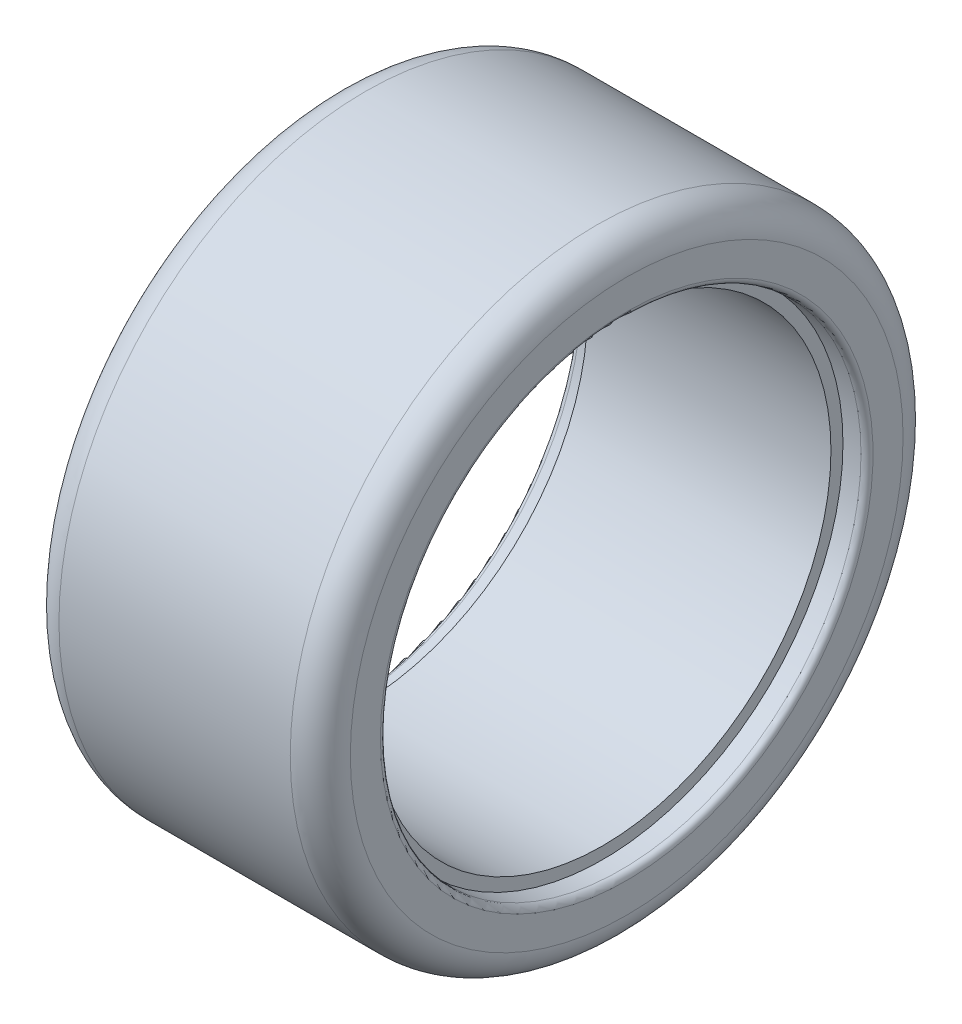
ISO-10303-21;
HEADER;
FILE_DESCRIPTION(('STEP AP214'),'2;1');
FILE_NAME('part.step','',(''),(''),'','','');
FILE_SCHEMA(('AUTOMOTIVE_DESIGN { 1 0 10303 214 1 1 1 1 }'));
ENDSEC;
DATA;
#1=APPLICATION_CONTEXT('core data for automotive mechanical design processes');
#2=APPLICATION_PROTOCOL_DEFINITION('international standard','automotive_design',2000,#1);
#3=PRODUCT_CONTEXT('',#1,'mechanical');
#4=PRODUCT('Part','Part','',(#3));
#5=PRODUCT_RELATED_PRODUCT_CATEGORY('part','',(#4));
#6=PRODUCT_DEFINITION_FORMATION('','',#4);
#7=PRODUCT_DEFINITION_CONTEXT('part definition',#1,'design');
#8=PRODUCT_DEFINITION('design','',#6,#7);
#9=PRODUCT_DEFINITION_SHAPE('','',#8);
#10=(LENGTH_UNIT() NAMED_UNIT(*) SI_UNIT(.MILLI.,.METRE.));
#11=(NAMED_UNIT(*) PLANE_ANGLE_UNIT() SI_UNIT($,.RADIAN.));
#12=(NAMED_UNIT(*) SI_UNIT($,.STERADIAN.) SOLID_ANGLE_UNIT());
#13=UNCERTAINTY_MEASURE_WITH_UNIT(LENGTH_MEASURE(1.E-05),#10,'distance_accuracy_value','');
#14=(GEOMETRIC_REPRESENTATION_CONTEXT(3) GLOBAL_UNCERTAINTY_ASSIGNED_CONTEXT((#13)) GLOBAL_UNIT_ASSIGNED_CONTEXT((#10,
#11,#12)) REPRESENTATION_CONTEXT('',''));
#15=CARTESIAN_POINT('',(0.,0.,0.));
#16=DIRECTION('',(0.,0.,1.));
#17=DIRECTION('',(1.,0.,0.));
#18=AXIS2_PLACEMENT_3D('',#15,#16,#17);
#19=CARTESIAN_POINT('',(0.,0.,0.));
#20=DIRECTION('',(-1.,0.,0.));
#21=DIRECTION('',(0.,0.,1.));
#22=AXIS2_PLACEMENT_3D('',#19,#20,#21);
#23=CYLINDRICAL_SURFACE('',#22,19.);
#24=CARTESIAN_POINT('',(10.125,0.,0.));
#25=DIRECTION('',(-1.,0.,0.));
#26=DIRECTION('',(0.,0.,1.));
#27=AXIS2_PLACEMENT_3D('',#24,#25,#26);
#28=CIRCLE('',#27,19.);
#29=CARTESIAN_POINT('',(10.125,0.,19.));
#30=VERTEX_POINT('',#29);
#31=EDGE_CURVE('E64',#30,#30,#28,.T.);
#32=ORIENTED_EDGE('',*,*,#31,.F.);
#33=EDGE_LOOP('',(#32));
#34=FACE_BOUND('',#33,.T.);
#35=CARTESIAN_POINT('',(-10.125,0.,0.));
#36=DIRECTION('',(-1.,0.,0.));
#37=DIRECTION('',(0.,0.,1.));
#38=AXIS2_PLACEMENT_3D('',#35,#36,#37);
#39=CIRCLE('',#38,19.);
#40=CARTESIAN_POINT('',(-10.125,0.,19.));
#41=VERTEX_POINT('',#40);
#42=EDGE_CURVE('E70',#41,#41,#39,.T.);
#43=ORIENTED_EDGE('',*,*,#42,.T.);
#44=EDGE_LOOP('',(#43));
#45=FACE_BOUND('',#44,.T.);
#46=ADVANCED_FACE('F32',(#34,#45),#23,.F.);
#47=CARTESIAN_POINT('',(10.125,0.,-19.));
#48=DIRECTION('',(-1.,0.,0.));
#49=DIRECTION('',(0.,0.,1.));
#50=AXIS2_PLACEMENT_3D('',#47,#48,#49);
#51=PLANE('',#50);
#52=CARTESIAN_POINT('',(10.125,0.,0.));
#53=DIRECTION('',(-1.,0.,0.));
#54=DIRECTION('',(0.,0.,1.));
#55=AXIS2_PLACEMENT_3D('',#52,#53,#54);
#56=CIRCLE('',#55,20.);
#57=CARTESIAN_POINT('',(10.125,0.,20.));
#58=VERTEX_POINT('',#57);
#59=EDGE_CURVE('E67',#58,#58,#56,.T.);
#60=ORIENTED_EDGE('',*,*,#59,.F.);
#61=EDGE_LOOP('',(#60));
#62=FACE_BOUND('',#61,.T.);
#63=ORIENTED_EDGE('',*,*,#31,.T.);
#64=EDGE_LOOP('',(#63));
#65=FACE_BOUND('',#64,.T.);
#66=ADVANCED_FACE('F93',(#62,#65),#51,.F.);
#67=CARTESIAN_POINT('',(0.,0.,0.));
#68=DIRECTION('',(-1.,0.,0.));
#69=DIRECTION('',(0.,0.,1.));
#70=AXIS2_PLACEMENT_3D('',#67,#68,#69);
#71=CYLINDRICAL_SURFACE('',#70,20.);
#72=CARTESIAN_POINT('',(11.625,0.,0.));
#73=DIRECTION('',(-1.,0.,0.));
#74=DIRECTION('',(0.,0.,1.));
#75=AXIS2_PLACEMENT_3D('',#72,#73,#74);
#76=CIRCLE('',#75,20.);
#77=CARTESIAN_POINT('',(11.625,0.,20.));
#78=VERTEX_POINT('',#77);
#79=EDGE_CURVE('E43',#78,#78,#76,.F.);
#80=ORIENTED_EDGE('',*,*,#79,.T.);
#81=EDGE_LOOP('',(#80));
#82=FACE_BOUND('',#81,.T.);
#83=ORIENTED_EDGE('',*,*,#59,.T.);
#84=EDGE_LOOP('',(#83));
#85=FACE_BOUND('',#84,.T.);
#86=ADVANCED_FACE('F99',(#82,#85),#71,.F.);
#87=CARTESIAN_POINT('',(12.125,0.,-20.));
#88=DIRECTION('',(-1.,0.,0.));
#89=DIRECTION('',(0.,0.,1.));
#90=AXIS2_PLACEMENT_3D('',#87,#88,#89);
#91=PLANE('',#90);
#92=CARTESIAN_POINT('',(12.125,0.,0.));
#93=DIRECTION('',(-1.,0.,0.));
#94=DIRECTION('',(0.,0.,1.));
#95=AXIS2_PLACEMENT_3D('',#92,#93,#94);
#96=CIRCLE('',#95,20.5);
#97=CARTESIAN_POINT('',(12.125,0.,20.5));
#98=VERTEX_POINT('',#97);
#99=EDGE_CURVE('E47',#98,#98,#96,.T.);
#100=ORIENTED_EDGE('',*,*,#99,.T.);
#101=EDGE_LOOP('',(#100));
#102=FACE_BOUND('',#101,.T.);
#103=CARTESIAN_POINT('',(12.125,0.,0.));
#104=DIRECTION('',(-1.,0.,0.));
#105=DIRECTION('',(0.,0.,1.));
#106=AXIS2_PLACEMENT_3D('',#103,#104,#105);
#107=CIRCLE('',#106,23.);
#108=CARTESIAN_POINT('',(12.125,0.,23.));
#109=VERTEX_POINT('',#108);
#110=EDGE_CURVE('E52',#109,#109,#107,.F.);
#111=ORIENTED_EDGE('',*,*,#110,.T.);
#112=EDGE_LOOP('',(#111));
#113=FACE_BOUND('',#112,.T.);
#114=ADVANCED_FACE('F123',(#102,#113),#91,.F.);
#115=CARTESIAN_POINT('',(0.,0.,0.));
#116=DIRECTION('',(-1.,0.,0.));
#117=DIRECTION('',(0.,0.,1.));
#118=AXIS2_PLACEMENT_3D('',#115,#116,#117);
#119=CYLINDRICAL_SURFACE('',#118,25.5);
#120=CARTESIAN_POINT('',(-9.625,0.,0.));
#121=DIRECTION('',(1.,0.,0.));
#122=DIRECTION('',(0.,0.,-1.));
#123=AXIS2_PLACEMENT_3D('',#120,#121,#122);
#124=CIRCLE('',#123,25.5);
#125=CARTESIAN_POINT('',(-9.625,0.,-25.5));
#126=VERTEX_POINT('',#125);
#127=EDGE_CURVE('E55',#126,#126,#124,.T.);
#128=ORIENTED_EDGE('',*,*,#127,.T.);
#129=EDGE_LOOP('',(#128));
#130=FACE_BOUND('',#129,.T.);
#131=CARTESIAN_POINT('',(9.625,0.,0.));
#132=DIRECTION('',(-1.,0.,0.));
#133=DIRECTION('',(0.,0.,1.));
#134=AXIS2_PLACEMENT_3D('',#131,#132,#133);
#135=CIRCLE('',#134,25.5);
#136=CARTESIAN_POINT('',(9.625,0.,25.5));
#137=VERTEX_POINT('',#136);
#138=EDGE_CURVE('E58',#137,#137,#135,.T.);
#139=ORIENTED_EDGE('',*,*,#138,.T.);
#140=EDGE_LOOP('',(#139));
#141=FACE_BOUND('',#140,.T.);
#142=ADVANCED_FACE('F90',(#130,#141),#119,.T.);
#143=CARTESIAN_POINT('',(-10.125,0.,-19.));
#144=DIRECTION('',(1.,0.,0.));
#145=DIRECTION('',(0.,0.,1.));
#146=AXIS2_PLACEMENT_3D('',#143,#144,#145);
#147=PLANE('',#146);
#148=CARTESIAN_POINT('',(-10.125,0.,0.));
#149=DIRECTION('',(-1.,0.,0.));
#150=DIRECTION('',(0.,0.,1.));
#151=AXIS2_PLACEMENT_3D('',#148,#149,#150);
#152=CIRCLE('',#151,20.);
#153=CARTESIAN_POINT('',(-10.125,0.,20.));
#154=VERTEX_POINT('',#153);
#155=EDGE_CURVE('E73',#154,#154,#152,.T.);
#156=ORIENTED_EDGE('',*,*,#155,.T.);
#157=EDGE_LOOP('',(#156));
#158=FACE_BOUND('',#157,.T.);
#159=ORIENTED_EDGE('',*,*,#42,.F.);
#160=EDGE_LOOP('',(#159));
#161=FACE_BOUND('',#160,.T.);
#162=ADVANCED_FACE('F77',(#158,#161),#147,.F.);
#163=CARTESIAN_POINT('',(0.,0.,0.));
#164=DIRECTION('',(1.,0.,0.));
#165=DIRECTION('',(0.,0.,1.));
#166=AXIS2_PLACEMENT_3D('',#163,#164,#165);
#167=CYLINDRICAL_SURFACE('',#166,20.);
#168=CARTESIAN_POINT('',(-11.625,0.,0.));
#169=DIRECTION('',(1.,0.,0.));
#170=DIRECTION('',(0.,0.,-1.));
#171=AXIS2_PLACEMENT_3D('',#168,#169,#170);
#172=CIRCLE('',#171,20.);
#173=CARTESIAN_POINT('',(-11.625,0.,-20.));
#174=VERTEX_POINT('',#173);
#175=EDGE_CURVE('E39',#174,#174,#172,.F.);
#176=ORIENTED_EDGE('',*,*,#175,.T.);
#177=EDGE_LOOP('',(#176));
#178=FACE_BOUND('',#177,.T.);
#179=ORIENTED_EDGE('',*,*,#155,.F.);
#180=EDGE_LOOP('',(#179));
#181=FACE_BOUND('',#180,.T.);
#182=ADVANCED_FACE('F80',(#178,#181),#167,.F.);
#183=CARTESIAN_POINT('',(-12.125,0.,-20.));
#184=DIRECTION('',(1.,0.,0.));
#185=DIRECTION('',(0.,0.,1.));
#186=AXIS2_PLACEMENT_3D('',#183,#184,#185);
#187=PLANE('',#186);
#188=CARTESIAN_POINT('',(-12.125,0.,0.));
#189=DIRECTION('',(1.,0.,0.));
#190=DIRECTION('',(0.,0.,-1.));
#191=AXIS2_PLACEMENT_3D('',#188,#189,#190);
#192=CIRCLE('',#191,20.5);
#193=CARTESIAN_POINT('',(-12.125,0.,-20.5));
#194=VERTEX_POINT('',#193);
#195=EDGE_CURVE('E10',#194,#194,#192,.T.);
#196=ORIENTED_EDGE('',*,*,#195,.T.);
#197=EDGE_LOOP('',(#196));
#198=FACE_BOUND('',#197,.T.);
#199=CARTESIAN_POINT('',(-12.125,0.,0.));
#200=DIRECTION('',(1.,0.,0.));
#201=DIRECTION('',(0.,0.,-1.));
#202=AXIS2_PLACEMENT_3D('',#199,#200,#201);
#203=CIRCLE('',#202,23.);
#204=CARTESIAN_POINT('',(-12.125,0.,-23.));
#205=VERTEX_POINT('',#204);
#206=EDGE_CURVE('E61',#205,#205,#203,.F.);
#207=ORIENTED_EDGE('',*,*,#206,.T.);
#208=EDGE_LOOP('',(#207));
#209=FACE_BOUND('',#208,.T.);
#210=ADVANCED_FACE('F82',(#198,#209),#187,.F.);
#211=CARTESIAN_POINT('',(-9.625,0.,0.));
#212=DIRECTION('',(1.,0.,0.));
#213=DIRECTION('',(0.,0.,-1.));
#214=AXIS2_PLACEMENT_3D('',#211,#212,#213);
#215=TOROIDAL_SURFACE('',#214,23.,2.5);
#216=ORIENTED_EDGE('',*,*,#127,.F.);
#217=EDGE_LOOP('',(#216));
#218=FACE_BOUND('',#217,.T.);
#219=ORIENTED_EDGE('',*,*,#206,.F.);
#220=EDGE_LOOP('',(#219));
#221=FACE_BOUND('',#220,.T.);
#222=ADVANCED_FACE('F88',(#218,#221),#215,.T.);
#223=CARTESIAN_POINT('',(9.625,0.,0.));
#224=DIRECTION('',(-1.,0.,0.));
#225=DIRECTION('',(0.,0.,1.));
#226=AXIS2_PLACEMENT_3D('',#223,#224,#225);
#227=TOROIDAL_SURFACE('',#226,23.,2.5);
#228=ORIENTED_EDGE('',*,*,#110,.F.);
#229=EDGE_LOOP('',(#228));
#230=FACE_BOUND('',#229,.T.);
#231=ORIENTED_EDGE('',*,*,#138,.F.);
#232=EDGE_LOOP('',(#231));
#233=FACE_BOUND('',#232,.T.);
#234=ADVANCED_FACE('F108',(#230,#233),#227,.T.);
#235=CARTESIAN_POINT('',(11.625,0.,0.));
#236=DIRECTION('',(-1.,0.,0.));
#237=DIRECTION('',(0.,0.,1.));
#238=AXIS2_PLACEMENT_3D('',#235,#236,#237);
#239=TOROIDAL_SURFACE('',#238,20.5,0.5);
#240=ORIENTED_EDGE('',*,*,#79,.F.);
#241=EDGE_LOOP('',(#240));
#242=FACE_BOUND('',#241,.T.);
#243=ORIENTED_EDGE('',*,*,#99,.F.);
#244=EDGE_LOOP('',(#243));
#245=FACE_BOUND('',#244,.T.);
#246=ADVANCED_FACE('F111',(#242,#245),#239,.T.);
#247=CARTESIAN_POINT('',(-11.625,0.,0.));
#248=DIRECTION('',(1.,0.,0.));
#249=DIRECTION('',(0.,0.,-1.));
#250=AXIS2_PLACEMENT_3D('',#247,#248,#249);
#251=TOROIDAL_SURFACE('',#250,20.5,0.5);
#252=ORIENTED_EDGE('',*,*,#195,.F.);
#253=EDGE_LOOP('',(#252));
#254=FACE_BOUND('',#253,.T.);
#255=ORIENTED_EDGE('',*,*,#175,.F.);
#256=EDGE_LOOP('',(#255));
#257=FACE_BOUND('',#256,.T.);
#258=ADVANCED_FACE('F34',(#254,#257),#251,.T.);
#259=CLOSED_SHELL('',(#46,#66,#86,#114,#142,#162,#182,#210,#222,#234,#246,#258));
#260=MANIFOLD_SOLID_BREP('B2',#259);
#261=ADVANCED_BREP_SHAPE_REPRESENTATION('',(#18,#260),#14);
#262=SHAPE_DEFINITION_REPRESENTATION(#9,#261);
ENDSEC;
END-ISO-10303-21;
